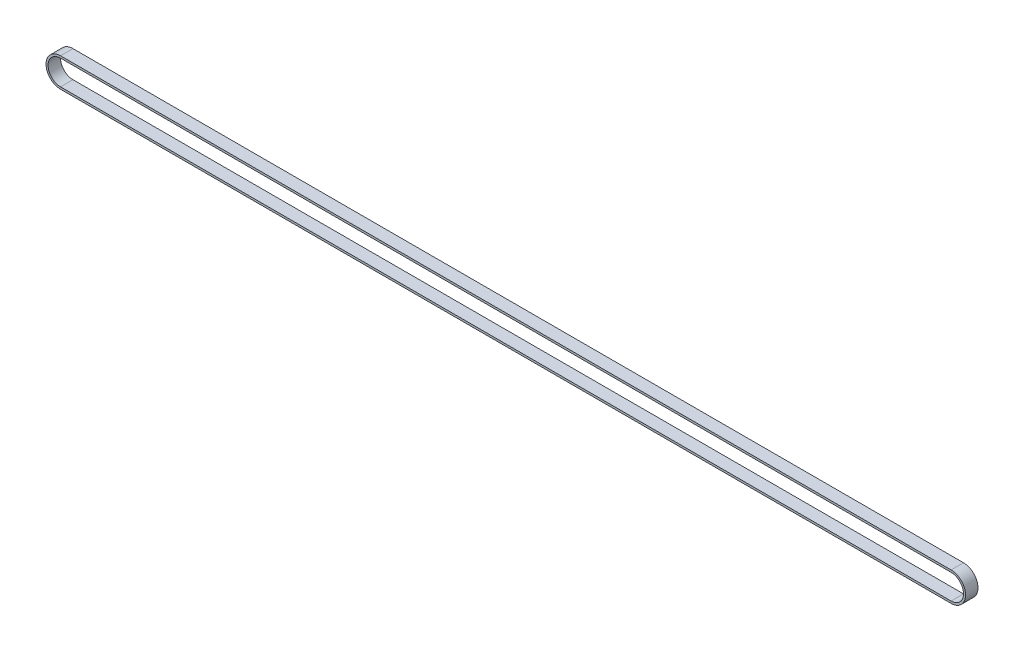
ISO-10303-21;
HEADER;
FILE_DESCRIPTION(('STEP AP214'),'2;1');
FILE_NAME('part.step','',(''),(''),'','','');
FILE_SCHEMA(('AUTOMOTIVE_DESIGN { 1 0 10303 214 1 1 1 1 }'));
ENDSEC;
DATA;
#1=APPLICATION_CONTEXT('core data for automotive mechanical design processes');
#2=APPLICATION_PROTOCOL_DEFINITION('international standard','automotive_design',2000,#1);
#3=PRODUCT_CONTEXT('',#1,'mechanical');
#4=PRODUCT('Part','Part','',(#3));
#5=PRODUCT_RELATED_PRODUCT_CATEGORY('part','',(#4));
#6=PRODUCT_DEFINITION_FORMATION('','',#4);
#7=PRODUCT_DEFINITION_CONTEXT('part definition',#1,'design');
#8=PRODUCT_DEFINITION('design','',#6,#7);
#9=PRODUCT_DEFINITION_SHAPE('','',#8);
#10=(LENGTH_UNIT() NAMED_UNIT(*) SI_UNIT(.MILLI.,.METRE.));
#11=(NAMED_UNIT(*) PLANE_ANGLE_UNIT() SI_UNIT($,.RADIAN.));
#12=(NAMED_UNIT(*) SI_UNIT($,.STERADIAN.) SOLID_ANGLE_UNIT());
#13=UNCERTAINTY_MEASURE_WITH_UNIT(LENGTH_MEASURE(1.E-05),#10,'distance_accuracy_value','');
#14=(GEOMETRIC_REPRESENTATION_CONTEXT(3) GLOBAL_UNCERTAINTY_ASSIGNED_CONTEXT((#13)) GLOBAL_UNIT_ASSIGNED_CONTEXT((#10,
#11,#12)) REPRESENTATION_CONTEXT('',''));
#15=CARTESIAN_POINT('',(0.,0.,0.));
#16=DIRECTION('',(0.,0.,1.));
#17=DIRECTION('',(1.,0.,0.));
#18=AXIS2_PLACEMENT_3D('',#15,#16,#17);
#19=CARTESIAN_POINT('',(0.,0.,6.));
#20=DIRECTION('',(0.,0.,1.));
#21=DIRECTION('',(1.,0.,0.));
#22=AXIS2_PLACEMENT_3D('',#19,#20,#21);
#23=PLANE('',#22);
#24=CARTESIAN_POINT('',(0.,0.,6.));
#25=DIRECTION('',(0.,0.,1.));
#26=DIRECTION('',(1.,0.,0.));
#27=AXIS2_PLACEMENT_3D('',#24,#25,#26);
#28=CIRCLE('',#27,7.);
#29=CARTESIAN_POINT('',(0.,7.,6.));
#30=VERTEX_POINT('',#29);
#31=CARTESIAN_POINT('',(0.,-7.,6.));
#32=VERTEX_POINT('',#31);
#33=EDGE_CURVE('E131',#30,#32,#28,.T.);
#34=ORIENTED_EDGE('',*,*,#33,.T.);
#35=DIRECTION('',(1.,0.,0.));
#36=VECTOR('',#35,1.);
#37=CARTESIAN_POINT('',(0.,-7.,6.));
#38=LINE('',#37,#36);
#39=CARTESIAN_POINT('',(430.,-7.,6.));
#40=VERTEX_POINT('',#39);
#41=EDGE_CURVE('E134',#32,#40,#38,.T.);
#42=ORIENTED_EDGE('',*,*,#41,.T.);
#43=CARTESIAN_POINT('',(430.,0.,6.));
#44=DIRECTION('',(0.,0.,1.));
#45=DIRECTION('',(1.,0.,0.));
#46=AXIS2_PLACEMENT_3D('',#43,#44,#45);
#47=CIRCLE('',#46,7.);
#48=CARTESIAN_POINT('',(430.,7.,6.));
#49=VERTEX_POINT('',#48);
#50=EDGE_CURVE('E137',#40,#49,#47,.T.);
#51=ORIENTED_EDGE('',*,*,#50,.T.);
#52=DIRECTION('',(-1.,0.,0.));
#53=VECTOR('',#52,1.);
#54=CARTESIAN_POINT('',(0.,7.,6.));
#55=LINE('',#54,#53);
#56=EDGE_CURVE('E139',#49,#30,#55,.T.);
#57=ORIENTED_EDGE('',*,*,#56,.T.);
#58=EDGE_LOOP('',(#34,#42,#51,#57));
#59=FACE_BOUND('',#58,.T.);
#60=DIRECTION('',(1.,0.,0.));
#61=VECTOR('',#60,1.);
#62=CARTESIAN_POINT('',(0.,-6.,6.));
#63=LINE('',#62,#61);
#64=CARTESIAN_POINT('',(0.,-6.,6.));
#65=VERTEX_POINT('',#64);
#66=CARTESIAN_POINT('',(430.,-6.,6.));
#67=VERTEX_POINT('',#66);
#68=EDGE_CURVE('E103',#65,#67,#63,.T.);
#69=ORIENTED_EDGE('',*,*,#68,.F.);
#70=CARTESIAN_POINT('',(0.,0.,6.));
#71=DIRECTION('',(0.,0.,1.));
#72=DIRECTION('',(1.,0.,0.));
#73=AXIS2_PLACEMENT_3D('',#70,#71,#72);
#74=CIRCLE('',#73,6.);
#75=CARTESIAN_POINT('',(0.,6.,6.));
#76=VERTEX_POINT('',#75);
#77=EDGE_CURVE('E95',#76,#65,#74,.T.);
#78=ORIENTED_EDGE('',*,*,#77,.F.);
#79=DIRECTION('',(-1.,0.,0.));
#80=VECTOR('',#79,1.);
#81=CARTESIAN_POINT('',(0.,6.,6.));
#82=LINE('',#81,#80);
#83=CARTESIAN_POINT('',(430.,6.,6.));
#84=VERTEX_POINT('',#83);
#85=EDGE_CURVE('E117',#84,#76,#82,.T.);
#86=ORIENTED_EDGE('',*,*,#85,.F.);
#87=CARTESIAN_POINT('',(430.,0.,6.));
#88=DIRECTION('',(0.,0.,1.));
#89=DIRECTION('',(1.,0.,0.));
#90=AXIS2_PLACEMENT_3D('',#87,#88,#89);
#91=CIRCLE('',#90,6.);
#92=EDGE_CURVE('E115',#67,#84,#91,.T.);
#93=ORIENTED_EDGE('',*,*,#92,.F.);
#94=EDGE_LOOP('',(#69,#78,#86,#93));
#95=FACE_BOUND('',#94,.T.);
#96=ADVANCED_FACE('F30',(#59,#95),#23,.T.);
#97=CARTESIAN_POINT('',(0.,0.,0.));
#98=DIRECTION('',(0.,0.,1.));
#99=DIRECTION('',(1.,0.,0.));
#100=AXIS2_PLACEMENT_3D('',#97,#98,#99);
#101=PLANE('',#100);
#102=CARTESIAN_POINT('',(0.,0.,0.));
#103=DIRECTION('',(0.,0.,1.));
#104=DIRECTION('',(1.,0.,0.));
#105=AXIS2_PLACEMENT_3D('',#102,#103,#104);
#106=CIRCLE('',#105,7.);
#107=CARTESIAN_POINT('',(0.,7.,0.));
#108=VERTEX_POINT('',#107);
#109=CARTESIAN_POINT('',(0.,-7.,0.));
#110=VERTEX_POINT('',#109);
#111=EDGE_CURVE('E111',#108,#110,#106,.T.);
#112=ORIENTED_EDGE('',*,*,#111,.F.);
#113=DIRECTION('',(-1.,0.,0.));
#114=VECTOR('',#113,1.);
#115=CARTESIAN_POINT('',(0.,7.,0.));
#116=LINE('',#115,#114);
#117=CARTESIAN_POINT('',(430.,7.,0.));
#118=VERTEX_POINT('',#117);
#119=EDGE_CURVE('E135',#118,#108,#116,.T.);
#120=ORIENTED_EDGE('',*,*,#119,.F.);
#121=CARTESIAN_POINT('',(430.,0.,0.));
#122=DIRECTION('',(0.,0.,1.));
#123=DIRECTION('',(1.,0.,0.));
#124=AXIS2_PLACEMENT_3D('',#121,#122,#123);
#125=CIRCLE('',#124,7.);
#126=CARTESIAN_POINT('',(430.,-7.,0.));
#127=VERTEX_POINT('',#126);
#128=EDGE_CURVE('E146',#127,#118,#125,.T.);
#129=ORIENTED_EDGE('',*,*,#128,.F.);
#130=DIRECTION('',(1.,0.,0.));
#131=VECTOR('',#130,1.);
#132=CARTESIAN_POINT('',(0.,-7.,0.));
#133=LINE('',#132,#131);
#134=EDGE_CURVE('E144',#110,#127,#133,.T.);
#135=ORIENTED_EDGE('',*,*,#134,.F.);
#136=EDGE_LOOP('',(#112,#120,#129,#135));
#137=FACE_BOUND('',#136,.T.);
#138=CARTESIAN_POINT('',(0.,0.,0.));
#139=DIRECTION('',(0.,0.,1.));
#140=DIRECTION('',(1.,0.,0.));
#141=AXIS2_PLACEMENT_3D('',#138,#139,#140);
#142=CIRCLE('',#141,6.);
#143=CARTESIAN_POINT('',(0.,6.,0.));
#144=VERTEX_POINT('',#143);
#145=CARTESIAN_POINT('',(0.,-6.,0.));
#146=VERTEX_POINT('',#145);
#147=EDGE_CURVE('E53',#144,#146,#142,.T.);
#148=ORIENTED_EDGE('',*,*,#147,.T.);
#149=DIRECTION('',(1.,0.,0.));
#150=VECTOR('',#149,1.);
#151=CARTESIAN_POINT('',(0.,-6.,0.));
#152=LINE('',#151,#150);
#153=CARTESIAN_POINT('',(430.,-6.,0.));
#154=VERTEX_POINT('',#153);
#155=EDGE_CURVE('E110',#146,#154,#152,.T.);
#156=ORIENTED_EDGE('',*,*,#155,.T.);
#157=CARTESIAN_POINT('',(430.,0.,0.));
#158=DIRECTION('',(0.,0.,1.));
#159=DIRECTION('',(1.,0.,0.));
#160=AXIS2_PLACEMENT_3D('',#157,#158,#159);
#161=CIRCLE('',#160,6.);
#162=CARTESIAN_POINT('',(430.,6.,0.));
#163=VERTEX_POINT('',#162);
#164=EDGE_CURVE('E123',#154,#163,#161,.T.);
#165=ORIENTED_EDGE('',*,*,#164,.T.);
#166=DIRECTION('',(-1.,0.,0.));
#167=VECTOR('',#166,1.);
#168=CARTESIAN_POINT('',(0.,6.,0.));
#169=LINE('',#168,#167);
#170=EDGE_CURVE('E104',#163,#144,#169,.T.);
#171=ORIENTED_EDGE('',*,*,#170,.T.);
#172=EDGE_LOOP('',(#148,#156,#165,#171));
#173=FACE_BOUND('',#172,.T.);
#174=ADVANCED_FACE('F164',(#137,#173),#101,.F.);
#175=CARTESIAN_POINT('',(0.,0.,6.));
#176=DIRECTION('',(0.,0.,-1.));
#177=DIRECTION('',(-1.,0.,0.));
#178=AXIS2_PLACEMENT_3D('',#175,#176,#177);
#179=CYLINDRICAL_SURFACE('',#178,7.);
#180=ORIENTED_EDGE('',*,*,#111,.T.);
#181=DIRECTION('',(0.,0.,-1.));
#182=VECTOR('',#181,1.);
#183=CARTESIAN_POINT('',(0.,-7.,6.));
#184=LINE('',#183,#182);
#185=EDGE_CURVE('E11',#32,#110,#184,.T.);
#186=ORIENTED_EDGE('',*,*,#185,.F.);
#187=ORIENTED_EDGE('',*,*,#33,.F.);
#188=DIRECTION('',(0.,0.,-1.));
#189=VECTOR('',#188,1.);
#190=CARTESIAN_POINT('',(0.,7.,6.));
#191=LINE('',#190,#189);
#192=EDGE_CURVE('E141',#30,#108,#191,.T.);
#193=ORIENTED_EDGE('',*,*,#192,.T.);
#194=EDGE_LOOP('',(#180,#186,#187,#193));
#195=FACE_BOUND('',#194,.T.);
#196=ADVANCED_FACE('F32',(#195),#179,.T.);
#197=CARTESIAN_POINT('',(0.,-7.,6.));
#198=DIRECTION('',(0.,1.,0.));
#199=DIRECTION('',(0.,0.,1.));
#200=AXIS2_PLACEMENT_3D('',#197,#198,#199);
#201=PLANE('',#200);
#202=ORIENTED_EDGE('',*,*,#134,.T.);
#203=DIRECTION('',(0.,0.,-1.));
#204=VECTOR('',#203,1.);
#205=CARTESIAN_POINT('',(430.,-7.,6.));
#206=LINE('',#205,#204);
#207=EDGE_CURVE('E38',#40,#127,#206,.T.);
#208=ORIENTED_EDGE('',*,*,#207,.F.);
#209=ORIENTED_EDGE('',*,*,#41,.F.);
#210=ORIENTED_EDGE('',*,*,#185,.T.);
#211=EDGE_LOOP('',(#202,#208,#209,#210));
#212=FACE_BOUND('',#211,.T.);
#213=ADVANCED_FACE('F174',(#212),#201,.F.);
#214=CARTESIAN_POINT('',(430.,0.,6.));
#215=DIRECTION('',(0.,0.,-1.));
#216=DIRECTION('',(-1.,0.,0.));
#217=AXIS2_PLACEMENT_3D('',#214,#215,#216);
#218=CYLINDRICAL_SURFACE('',#217,7.);
#219=ORIENTED_EDGE('',*,*,#128,.T.);
#220=DIRECTION('',(0.,0.,-1.));
#221=VECTOR('',#220,1.);
#222=CARTESIAN_POINT('',(430.,7.,6.));
#223=LINE('',#222,#221);
#224=EDGE_CURVE('E151',#49,#118,#223,.T.);
#225=ORIENTED_EDGE('',*,*,#224,.F.);
#226=ORIENTED_EDGE('',*,*,#50,.F.);
#227=ORIENTED_EDGE('',*,*,#207,.T.);
#228=EDGE_LOOP('',(#219,#225,#226,#227));
#229=FACE_BOUND('',#228,.T.);
#230=ADVANCED_FACE('F158',(#229),#218,.T.);
#231=CARTESIAN_POINT('',(0.,7.,6.));
#232=DIRECTION('',(0.,-1.,0.));
#233=DIRECTION('',(0.,0.,-1.));
#234=AXIS2_PLACEMENT_3D('',#231,#232,#233);
#235=PLANE('',#234);
#236=ORIENTED_EDGE('',*,*,#119,.T.);
#237=ORIENTED_EDGE('',*,*,#192,.F.);
#238=ORIENTED_EDGE('',*,*,#56,.F.);
#239=ORIENTED_EDGE('',*,*,#224,.T.);
#240=EDGE_LOOP('',(#236,#237,#238,#239));
#241=FACE_BOUND('',#240,.T.);
#242=ADVANCED_FACE('F168',(#241),#235,.F.);
#243=CARTESIAN_POINT('',(0.,0.,6.));
#244=DIRECTION('',(0.,0.,-1.));
#245=DIRECTION('',(-1.,0.,0.));
#246=AXIS2_PLACEMENT_3D('',#243,#244,#245);
#247=CYLINDRICAL_SURFACE('',#246,6.);
#248=ORIENTED_EDGE('',*,*,#147,.F.);
#249=DIRECTION('',(0.,0.,-1.));
#250=VECTOR('',#249,1.);
#251=CARTESIAN_POINT('',(0.,6.,6.));
#252=LINE('',#251,#250);
#253=EDGE_CURVE('E99',#76,#144,#252,.T.);
#254=ORIENTED_EDGE('',*,*,#253,.F.);
#255=ORIENTED_EDGE('',*,*,#77,.T.);
#256=DIRECTION('',(0.,0.,-1.));
#257=VECTOR('',#256,1.);
#258=CARTESIAN_POINT('',(0.,-6.,6.));
#259=LINE('',#258,#257);
#260=EDGE_CURVE('E98',#65,#146,#259,.T.);
#261=ORIENTED_EDGE('',*,*,#260,.T.);
#262=EDGE_LOOP('',(#248,#254,#255,#261));
#263=FACE_BOUND('',#262,.T.);
#264=ADVANCED_FACE('F97',(#263),#247,.F.);
#265=CARTESIAN_POINT('',(0.,-6.,6.));
#266=DIRECTION('',(0.,1.,0.));
#267=DIRECTION('',(-1.,0.,0.));
#268=AXIS2_PLACEMENT_3D('',#265,#266,#267);
#269=PLANE('',#268);
#270=ORIENTED_EDGE('',*,*,#155,.F.);
#271=ORIENTED_EDGE('',*,*,#260,.F.);
#272=ORIENTED_EDGE('',*,*,#68,.T.);
#273=DIRECTION('',(0.,0.,-1.));
#274=VECTOR('',#273,1.);
#275=CARTESIAN_POINT('',(430.,-6.,6.));
#276=LINE('',#275,#274);
#277=EDGE_CURVE('E112',#67,#154,#276,.T.);
#278=ORIENTED_EDGE('',*,*,#277,.T.);
#279=EDGE_LOOP('',(#270,#271,#272,#278));
#280=FACE_BOUND('',#279,.T.);
#281=ADVANCED_FACE('F107',(#280),#269,.T.);
#282=CARTESIAN_POINT('',(430.,0.,6.));
#283=DIRECTION('',(0.,0.,-1.));
#284=DIRECTION('',(-1.,0.,0.));
#285=AXIS2_PLACEMENT_3D('',#282,#283,#284);
#286=CYLINDRICAL_SURFACE('',#285,6.);
#287=ORIENTED_EDGE('',*,*,#164,.F.);
#288=ORIENTED_EDGE('',*,*,#277,.F.);
#289=ORIENTED_EDGE('',*,*,#92,.T.);
#290=DIRECTION('',(0.,0.,-1.));
#291=VECTOR('',#290,1.);
#292=CARTESIAN_POINT('',(430.,6.,6.));
#293=LINE('',#292,#291);
#294=EDGE_CURVE('E45',#84,#163,#293,.T.);
#295=ORIENTED_EDGE('',*,*,#294,.T.);
#296=EDGE_LOOP('',(#287,#288,#289,#295));
#297=FACE_BOUND('',#296,.T.);
#298=ADVANCED_FACE('F197',(#297),#286,.F.);
#299=CARTESIAN_POINT('',(0.,6.,6.));
#300=DIRECTION('',(0.,-1.,0.));
#301=DIRECTION('',(1.,0.,0.));
#302=AXIS2_PLACEMENT_3D('',#299,#300,#301);
#303=PLANE('',#302);
#304=ORIENTED_EDGE('',*,*,#170,.F.);
#305=ORIENTED_EDGE('',*,*,#294,.F.);
#306=ORIENTED_EDGE('',*,*,#85,.T.);
#307=ORIENTED_EDGE('',*,*,#253,.T.);
#308=EDGE_LOOP('',(#304,#305,#306,#307));
#309=FACE_BOUND('',#308,.T.);
#310=ADVANCED_FACE('F201',(#309),#303,.T.);
#311=CLOSED_SHELL('',(#96,#174,#196,#213,#230,#242,#264,#281,#298,#310));
#312=MANIFOLD_SOLID_BREP('B2',#311);
#313=ADVANCED_BREP_SHAPE_REPRESENTATION('',(#18,#312),#14);
#314=SHAPE_DEFINITION_REPRESENTATION(#9,#313);
ENDSEC;
END-ISO-10303-21;
